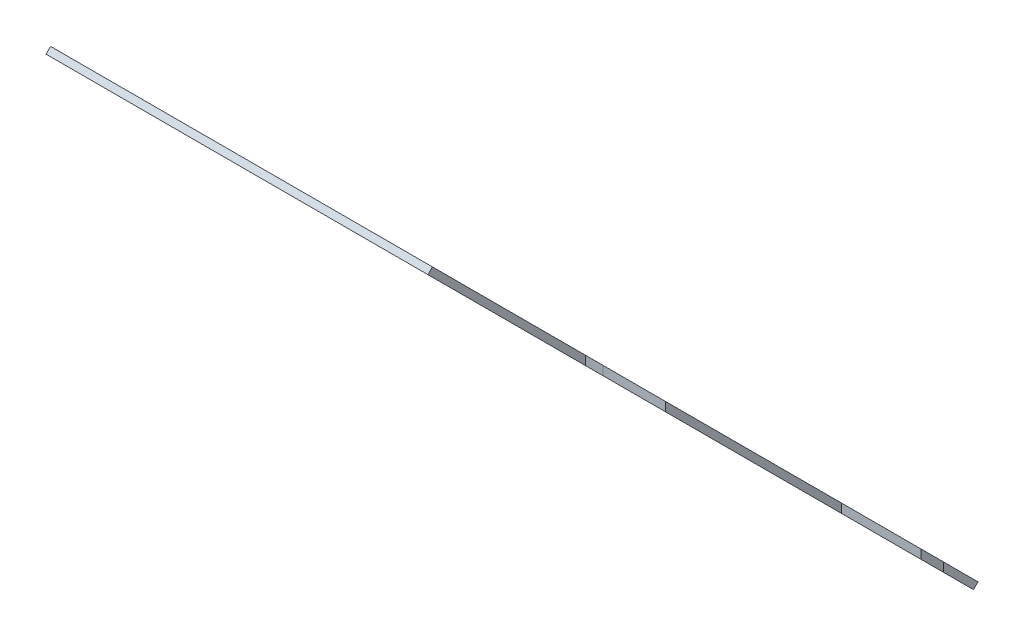
ISO-10303-21;
HEADER;
FILE_DESCRIPTION(('STEP AP214'),'2;1');
FILE_NAME('part.step','',(''),(''),'','','');
FILE_SCHEMA(('AUTOMOTIVE_DESIGN { 1 0 10303 214 1 1 1 1 }'));
ENDSEC;
DATA;
#1=APPLICATION_CONTEXT('core data for automotive mechanical design processes');
#2=APPLICATION_PROTOCOL_DEFINITION('international standard','automotive_design',2000,#1);
#3=PRODUCT_CONTEXT('',#1,'mechanical');
#4=PRODUCT('Part','Part','',(#3));
#5=PRODUCT_RELATED_PRODUCT_CATEGORY('part','',(#4));
#6=PRODUCT_DEFINITION_FORMATION('','',#4);
#7=PRODUCT_DEFINITION_CONTEXT('part definition',#1,'design');
#8=PRODUCT_DEFINITION('design','',#6,#7);
#9=PRODUCT_DEFINITION_SHAPE('','',#8);
#10=(LENGTH_UNIT() NAMED_UNIT(*) SI_UNIT(.MILLI.,.METRE.));
#11=(NAMED_UNIT(*) PLANE_ANGLE_UNIT() SI_UNIT($,.RADIAN.));
#12=(NAMED_UNIT(*) SI_UNIT($,.STERADIAN.) SOLID_ANGLE_UNIT());
#13=UNCERTAINTY_MEASURE_WITH_UNIT(LENGTH_MEASURE(1.E-05),#10,'distance_accuracy_value','');
#14=(GEOMETRIC_REPRESENTATION_CONTEXT(3) GLOBAL_UNCERTAINTY_ASSIGNED_CONTEXT((#13)) GLOBAL_UNIT_ASSIGNED_CONTEXT((#10,
#11,#12)) REPRESENTATION_CONTEXT('',''));
#15=CARTESIAN_POINT('',(0.,0.,0.));
#16=DIRECTION('',(0.,0.,1.));
#17=DIRECTION('',(1.,0.,0.));
#18=AXIS2_PLACEMENT_3D('',#15,#16,#17);
#19=CARTESIAN_POINT('',(-23399.5611417281,4644.14890589794,40199.9001950679));
#20=DIRECTION('',(0.,0.,-1.));
#21=DIRECTION('',(-1.,0.,0.));
#22=AXIS2_PLACEMENT_3D('',#19,#20,#21);
#23=PLANE('',#22);
#24=DIRECTION('',(1.,0.,0.));
#25=VECTOR('',#24,1.);
#26=CARTESIAN_POINT('',(-23399.5611417281,2810.99010375557,40199.9001950679));
#27=LINE('',#26,#25);
#28=CARTESIAN_POINT('',(-22901.5611417281,2810.99010375557,40199.9001950679));
#29=VERTEX_POINT('',#28);
#30=CARTESIAN_POINT('',(-22799.5611417281,2810.99010375557,40199.9001950679));
#31=VERTEX_POINT('',#30);
#32=EDGE_CURVE('E549',#29,#31,#27,.T.);
#33=ORIENTED_EDGE('',*,*,#32,.F.);
#34=DIRECTION('',(0.,1.,0.));
#35=VECTOR('',#34,1.);
#36=CARTESIAN_POINT('',(-22901.5611417281,0.,40199.9001950679));
#37=LINE('',#36,#35);
#38=CARTESIAN_POINT('',(-22901.5611417281,2825.1322393793,40199.9001950679));
#39=VERTEX_POINT('',#38);
#40=EDGE_CURVE('E491',#29,#39,#37,.T.);
#41=ORIENTED_EDGE('',*,*,#40,.T.);
#42=DIRECTION('',(1.,0.,0.));
#43=VECTOR('',#42,1.);
#44=CARTESIAN_POINT('',(-23399.5611417281,2825.1322393793,40199.9001950679));
#45=LINE('',#44,#43);
#46=CARTESIAN_POINT('',(-22799.5611417281,2825.1322393793,40199.9001950679));
#47=VERTEX_POINT('',#46);
#48=EDGE_CURVE('E570',#39,#47,#45,.T.);
#49=ORIENTED_EDGE('',*,*,#48,.T.);
#50=DIRECTION('',(0.,1.,0.));
#51=VECTOR('',#50,1.);
#52=CARTESIAN_POINT('',(-22799.5611417281,4644.14890589794,40199.9001950679));
#53=LINE('',#52,#51);
#54=EDGE_CURVE('E553',#31,#47,#53,.T.);
#55=ORIENTED_EDGE('',*,*,#54,.F.);
#56=EDGE_LOOP('',(#33,#41,#49,#55));
#57=FACE_BOUND('',#56,.T.);
#58=ADVANCED_FACE('F134',(#57),#23,.T.);
#59=CARTESIAN_POINT('',(-22799.5611417283,0.,1.12500434359537E-10));
#60=DIRECTION('',(-1.,0.,0.));
#61=DIRECTION('',(0.,0.,1.));
#62=AXIS2_PLACEMENT_3D('',#59,#60,#61);
#63=PLANE('',#62);
#64=DIRECTION('',(0.,-0.707106781186551,-0.707106781186544));
#65=VECTOR('',#64,1.);
#66=CARTESIAN_POINT('',(-22799.5611417281,3727.56950482676,41116.4795961391));
#67=LINE('',#66,#65);
#68=CARTESIAN_POINT('',(-22799.5611417281,3247.90013102599,40636.8102223383));
#69=VERTEX_POINT('',#68);
#70=CARTESIAN_POINT('',(-22799.5611417374,2971.2637149673,40360.1738062797));
#71=VERTEX_POINT('',#70);
#72=EDGE_CURVE('E554',#69,#71,#67,.T.);
#73=ORIENTED_EDGE('',*,*,#72,.T.);
#74=DIRECTION('',(0.,1.,0.));
#75=VECTOR('',#74,1.);
#76=CARTESIAN_POINT('',(-22799.5611417281,0.,40360.1738062797));
#77=LINE('',#76,#75);
#78=CARTESIAN_POINT('',(-22799.5611417374,2985.40585059103,40360.1738062797));
#79=VERTEX_POINT('',#78);
#80=EDGE_CURVE('E581',#71,#79,#77,.T.);
#81=ORIENTED_EDGE('',*,*,#80,.T.);
#82=DIRECTION('',(0.,0.70710678118655,0.707106781186545));
#83=VECTOR('',#82,1.);
#84=CARTESIAN_POINT('',(-22799.5611417281,3734.64057263863,41109.4085283273));
#85=LINE('',#84,#83);
#86=CARTESIAN_POINT('',(-22799.5611417281,3262.04226664972,40636.8102223383));
#87=VERTEX_POINT('',#86);
#88=EDGE_CURVE('E561',#79,#87,#85,.T.);
#89=ORIENTED_EDGE('',*,*,#88,.T.);
#90=DIRECTION('',(0.,-1.,0.));
#91=VECTOR('',#90,1.);
#92=CARTESIAN_POINT('',(-22799.5611417281,0.,40636.8102223383));
#93=LINE('',#92,#91);
#94=EDGE_CURVE('E566',#87,#69,#93,.T.);
#95=ORIENTED_EDGE('',*,*,#94,.T.);
#96=EDGE_LOOP('',(#73,#81,#89,#95));
#97=FACE_BOUND('',#96,.T.);
#98=ADVANCED_FACE('F602',(#97),#63,.F.);
#99=CARTESIAN_POINT('',(-22799.5611417281,3620.81394438943,41009.7240357018));
#100=VERTEX_POINT('',#99);
#101=CARTESIAN_POINT('',(-22799.5611417281,3373.04732691161,40761.957418224));
#102=VERTEX_POINT('',#101);
#103=EDGE_CURVE('E550',#100,#102,#67,.T.);
#104=ORIENTED_EDGE('',*,*,#103,.T.);
#105=DIRECTION('',(0.,1.,0.));
#106=VECTOR('',#105,1.);
#107=CARTESIAN_POINT('',(-22799.5611417281,0.,40761.957418224));
#108=LINE('',#107,#106);
#109=CARTESIAN_POINT('',(-22799.5611417281,3387.18946253534,40761.957418224));
#110=VERTEX_POINT('',#109);
#111=EDGE_CURVE('E575',#102,#110,#108,.T.);
#112=ORIENTED_EDGE('',*,*,#111,.T.);
#113=CARTESIAN_POINT('',(-22799.5611417281,3627.8850122013,41002.6529678899));
#114=VERTEX_POINT('',#113);
#115=EDGE_CURVE('E557',#110,#114,#85,.T.);
#116=ORIENTED_EDGE('',*,*,#115,.T.);
#117=DIRECTION('',(0.,-0.707106781186659,0.707106781186437));
#118=VECTOR('',#117,1.);
#119=CARTESIAN_POINT('',(-22799.5611417281,4537.39334546078,40093.1446346307));
#120=LINE('',#119,#118);
#121=EDGE_CURVE('E543',#114,#100,#120,.T.);
#122=ORIENTED_EDGE('',*,*,#121,.T.);
#123=EDGE_LOOP('',(#104,#112,#116,#122));
#124=FACE_BOUND('',#123,.T.);
#125=ADVANCED_FACE('F643',(#124),#63,.F.);
#126=CARTESIAN_POINT('',(-23399.5611417281,3727.56950482676,41116.4795961391));
#127=DIRECTION('',(0.,-0.707106781186544,0.707106781186551));
#128=DIRECTION('',(0.,-0.707106781186551,-0.707106781186544));
#129=AXIS2_PLACEMENT_3D('',#126,#127,#128);
#130=PLANE('',#129);
#131=CARTESIAN_POINT('',(-23359.5611417281,2813.47366232214,40202.3837536345));
#132=DIRECTION('',(0.,-0.707106781186544,0.707106781186551));
#133=DIRECTION('',(0.,-0.707106781186551,-0.707106781186544));
#134=AXIS2_PLACEMENT_3D('',#131,#132,#133);
#135=CIRCLE('',#134,10.0000000000016);
#136=CARTESIAN_POINT('',(-23369.5611417281,2813.47366232214,40202.3837536345));
#137=VERTEX_POINT('',#136);
#138=CARTESIAN_POINT('',(-23359.5611417281,2806.40259451028,40195.3126858226));
#139=VERTEX_POINT('',#138);
#140=EDGE_CURVE('E460',#137,#139,#135,.T.);
#141=ORIENTED_EDGE('',*,*,#140,.F.);
#142=DIRECTION('',(0.,-0.707106781186551,-0.707106781186544));
#143=VECTOR('',#142,1.);
#144=CARTESIAN_POINT('',(-23369.5611417281,3727.56950482676,41116.4795961391));
#145=LINE('',#144,#143);
#146=CARTESIAN_POINT('',(-23369.5611417281,3339.56110752494,40728.4711988373));
#147=VERTEX_POINT('',#146);
#148=EDGE_CURVE('E450',#147,#137,#145,.T.);
#149=ORIENTED_EDGE('',*,*,#148,.F.);
#150=CARTESIAN_POINT('',(-23359.5611417281,3339.56110752494,40728.4711988373));
#151=DIRECTION('',(0.,-0.707106781186544,0.707106781186551));
#152=DIRECTION('',(0.,-0.707106781186551,-0.707106781186544));
#153=AXIS2_PLACEMENT_3D('',#150,#151,#152);
#154=CIRCLE('',#153,9.99999999999973);
#155=CARTESIAN_POINT('',(-23359.5611417281,3346.6321753368,40735.5422666492));
#156=VERTEX_POINT('',#155);
#157=EDGE_CURVE('E485',#156,#147,#154,.T.);
#158=ORIENTED_EDGE('',*,*,#157,.F.);
#159=DIRECTION('',(-1.,0.,0.));
#160=VECTOR('',#159,1.);
#161=CARTESIAN_POINT('',(-23399.5611417281,3346.6321753368,40735.5422666492));
#162=LINE('',#161,#160);
#163=CARTESIAN_POINT('',(-23039.5611417281,3346.6321753368,40735.5422666492));
#164=VERTEX_POINT('',#163);
#165=EDGE_CURVE('E479',#164,#156,#162,.T.);
#166=ORIENTED_EDGE('',*,*,#165,.F.);
#167=CARTESIAN_POINT('',(-23039.5611417281,3339.56110752494,40728.4711988373));
#168=DIRECTION('',(0.,-0.707106781186544,0.707106781186551));
#169=DIRECTION('',(0.,-0.707106781186551,-0.707106781186544));
#170=AXIS2_PLACEMENT_3D('',#167,#168,#169);
#171=CIRCLE('',#170,10.0000000000048);
#172=CARTESIAN_POINT('',(-23039.5611417281,3332.49003971306,40721.4001310254));
#173=VERTEX_POINT('',#172);
#174=EDGE_CURVE('E350',#173,#164,#171,.T.);
#175=ORIENTED_EDGE('',*,*,#174,.F.);
#176=DIRECTION('',(-1.,0.,0.));
#177=VECTOR('',#176,1.);
#178=CARTESIAN_POINT('',(-23399.5611417281,3332.49003971307,40721.4001310254));
#179=LINE('',#178,#177);
#180=CARTESIAN_POINT('',(-23349.5611417281,3332.49003971307,40721.4001310254));
#181=VERTEX_POINT('',#180);
#182=EDGE_CURVE('E482',#173,#181,#179,.T.);
#183=ORIENTED_EDGE('',*,*,#182,.T.);
#184=DIRECTION('',(0.,-0.707106781186551,-0.707106781186544));
#185=VECTOR('',#184,1.);
#186=CARTESIAN_POINT('',(-23349.5611417281,3727.56950482676,41116.4795961391));
#187=LINE('',#186,#185);
#188=CARTESIAN_POINT('',(-23349.5611417281,3219.35295472323,40608.2630460356));
#189=VERTEX_POINT('',#188);
#190=EDGE_CURVE('E380',#181,#189,#187,.T.);
#191=ORIENTED_EDGE('',*,*,#190,.T.);
#192=DIRECTION('',(-1.,0.,0.));
#193=VECTOR('',#192,1.);
#194=CARTESIAN_POINT('',(-23399.5611417281,3219.35295472322,40608.2630460356));
#195=LINE('',#194,#193);
#196=CARTESIAN_POINT('',(-23039.5611417281,3219.35295472323,40608.2630460356));
#197=VERTEX_POINT('',#196);
#198=EDGE_CURVE('E448',#197,#189,#195,.T.);
#199=ORIENTED_EDGE('',*,*,#198,.F.);
#200=CARTESIAN_POINT('',(-23039.5611417281,3212.28188691136,40601.1919782237));
#201=DIRECTION('',(0.,-0.707106781186544,0.707106781186551));
#202=DIRECTION('',(0.,-0.707106781186551,-0.707106781186544));
#203=AXIS2_PLACEMENT_3D('',#200,#201,#202);
#204=CIRCLE('',#203,10.0000000000073);
#205=CARTESIAN_POINT('',(-23039.5611417281,3205.21081909949,40594.1209104118));
#206=VERTEX_POINT('',#205);
#207=EDGE_CURVE('E452',#206,#197,#204,.T.);
#208=ORIENTED_EDGE('',*,*,#207,.F.);
#209=DIRECTION('',(-1.,0.,0.));
#210=VECTOR('',#209,1.);
#211=CARTESIAN_POINT('',(-23399.5611417281,3205.21081909949,40594.1209104118));
#212=LINE('',#211,#210);
#213=CARTESIAN_POINT('',(-23349.5611417281,3205.21081909949,40594.1209104118));
#214=VERTEX_POINT('',#213);
#215=EDGE_CURVE('E454',#206,#214,#212,.T.);
#216=ORIENTED_EDGE('',*,*,#215,.T.);
#217=DIRECTION('',(0.,-0.707106781186551,-0.707106781186544));
#218=VECTOR('',#217,1.);
#219=CARTESIAN_POINT('',(-23349.5611417281,3727.56950482676,41116.4795961391));
#220=LINE('',#219,#218);
#221=CARTESIAN_POINT('',(-23349.5611417281,2947.82395074758,40336.7340420599));
#222=VERTEX_POINT('',#221);
#223=EDGE_CURVE('E457',#214,#222,#220,.T.);
#224=ORIENTED_EDGE('',*,*,#223,.T.);
#225=DIRECTION('',(1.,0.,0.));
#226=VECTOR('',#225,1.);
#227=CARTESIAN_POINT('',(-23399.561141728,2947.82395074758,40336.7340420599));
#228=LINE('',#227,#226);
#229=CARTESIAN_POINT('',(-23164.5611417281,2947.82395074759,40336.7340420599));
#230=VERTEX_POINT('',#229);
#231=EDGE_CURVE('E462',#222,#230,#228,.T.);
#232=ORIENTED_EDGE('',*,*,#231,.T.);
#233=CARTESIAN_POINT('',(-23164.5611417281,2940.75288293572,40329.6629742481));
#234=DIRECTION('',(0.,-0.707106781186544,0.707106781186551));
#235=DIRECTION('',(0.,-0.707106781186551,-0.707106781186544));
#236=AXIS2_PLACEMENT_3D('',#233,#234,#235);
#237=CIRCLE('',#236,10.0000000000035);
#238=CARTESIAN_POINT('',(-23164.5611417281,2933.68181512385,40322.5919064362));
#239=VERTEX_POINT('',#238);
#240=EDGE_CURVE('E470',#239,#230,#237,.T.);
#241=ORIENTED_EDGE('',*,*,#240,.F.);
#242=DIRECTION('',(1.,0.,0.));
#243=VECTOR('',#242,1.);
#244=CARTESIAN_POINT('',(-23399.5611417281,2933.68181512386,40322.5919064362));
#245=LINE('',#244,#243);
#246=CARTESIAN_POINT('',(-23349.5611417281,2933.68181512386,40322.5919064362));
#247=VERTEX_POINT('',#246);
#248=EDGE_CURVE('E472',#247,#239,#245,.T.);
#249=ORIENTED_EDGE('',*,*,#248,.F.);
#250=DIRECTION('',(0.,-0.707106781186551,-0.707106781186544));
#251=VECTOR('',#250,1.);
#252=CARTESIAN_POINT('',(-23349.5611417281,3727.56950482676,41116.4795961391));
#253=LINE('',#252,#251);
#254=CARTESIAN_POINT('',(-23349.5611417281,2820.54473013401,40209.4548214464));
#255=VERTEX_POINT('',#254);
#256=EDGE_CURVE('E465',#247,#255,#253,.T.);
#257=ORIENTED_EDGE('',*,*,#256,.T.);
#258=DIRECTION('',(1.,0.,0.));
#259=VECTOR('',#258,1.);
#260=CARTESIAN_POINT('',(-23399.5611417281,2820.54473013401,40209.4548214464));
#261=LINE('',#260,#259);
#262=CARTESIAN_POINT('',(-23164.5611417281,2820.54473013401,40209.4548214464));
#263=VERTEX_POINT('',#262);
#264=EDGE_CURVE('E474',#255,#263,#261,.T.);
#265=ORIENTED_EDGE('',*,*,#264,.T.);
#266=CARTESIAN_POINT('',(-23164.5611417281,2813.47366232214,40202.3837536345));
#267=DIRECTION('',(0.,-0.707106781186544,0.707106781186551));
#268=DIRECTION('',(0.,-0.707106781186551,-0.707106781186544));
#269=AXIS2_PLACEMENT_3D('',#266,#267,#268);
#270=CIRCLE('',#269,9.99999999999973);
#271=CARTESIAN_POINT('',(-23164.5611417281,2806.40259451028,40195.3126858226));
#272=VERTEX_POINT('',#271);
#273=EDGE_CURVE('E477',#272,#263,#270,.T.);
#274=ORIENTED_EDGE('',*,*,#273,.F.);
#275=DIRECTION('',(1.,0.,0.));
#276=VECTOR('',#275,1.);
#277=CARTESIAN_POINT('',(-23399.5611417281,2806.40259451027,40195.3126858226));
#278=LINE('',#277,#276);
#279=EDGE_CURVE('E468',#139,#272,#278,.T.);
#280=ORIENTED_EDGE('',*,*,#279,.F.);
#281=EDGE_LOOP('',(#141,#149,#158,#166,#175,#183,#191,#199,#208,#216,#224,#232,#241,#249,#257,
#265,#274,#280));
#282=FACE_BOUND('',#281,.T.);
#283=DIRECTION('',(-1.,0.,0.));
#284=VECTOR('',#283,1.);
#285=CARTESIAN_POINT('',(-23399.5611417281,2971.2637149673,40360.1738062797));
#286=LINE('',#285,#284);
#287=CARTESIAN_POINT('',(-23030.5480978763,2971.2637149673,40360.1738062797));
#288=VERTEX_POINT('',#287);
#289=EDGE_CURVE('E533',#71,#288,#286,.T.);
#290=ORIENTED_EDGE('',*,*,#289,.F.);
#291=ORIENTED_EDGE('',*,*,#72,.F.);
#292=DIRECTION('',(1.,0.,0.));
#293=VECTOR('',#292,1.);
#294=CARTESIAN_POINT('',(-23399.5611417281,3247.90013102604,40636.8102223384));
#295=LINE('',#294,#293);
#296=CARTESIAN_POINT('',(-22897.4106010305,3247.900131026,40636.8102223383));
#297=VERTEX_POINT('',#296);
#298=EDGE_CURVE('E521',#297,#69,#295,.T.);
#299=ORIENTED_EDGE('',*,*,#298,.F.);
#300=CARTESIAN_POINT('',(-22897.4106010305,3310.4737289688,40699.3838202812));
#301=DIRECTION('',(0.,-0.707106781186544,0.707106781186551));
#302=DIRECTION('',(0.,0.707106781186551,0.707106781186544));
#303=AXIS2_PLACEMENT_3D('',#300,#301,#302);
#304=ELLIPSE('',#303,88.4924308572015,62.5735979428086);
#305=CARTESIAN_POINT('',(-22897.4106010305,3373.04732691162,40761.957418224));
#306=VERTEX_POINT('',#305);
#307=EDGE_CURVE('E535',#306,#297,#304,.T.);
#308=ORIENTED_EDGE('',*,*,#307,.F.);
#309=DIRECTION('',(-1.,0.,0.));
#310=VECTOR('',#309,1.);
#311=CARTESIAN_POINT('',(-23399.5611417281,3373.04732691165,40761.957418224));
#312=LINE('',#311,#310);
#313=EDGE_CURVE('E525',#102,#306,#312,.T.);
#314=ORIENTED_EDGE('',*,*,#313,.F.);
#315=ORIENTED_EDGE('',*,*,#103,.F.);
#316=DIRECTION('',(1.,0.,0.));
#317=VECTOR('',#316,1.);
#318=CARTESIAN_POINT('',(-23399.5611417281,3620.81394438943,41009.7240357018));
#319=LINE('',#318,#317);
#320=CARTESIAN_POINT('',(-23399.5611417281,3620.81394438943,41009.7240357018));
#321=VERTEX_POINT('',#320);
#322=EDGE_CURVE('E564',#321,#100,#319,.T.);
#323=ORIENTED_EDGE('',*,*,#322,.F.);
#324=DIRECTION('',(0.,-0.707106781186551,-0.707106781186544));
#325=VECTOR('',#324,1.);
#326=CARTESIAN_POINT('',(-23399.5611417281,3727.56950482676,41116.4795961391));
#327=LINE('',#326,#325);
#328=CARTESIAN_POINT('',(-23399.5611417281,2661.79925775763,40050.70934907));
#329=VERTEX_POINT('',#328);
#330=EDGE_CURVE('E540',#321,#329,#327,.T.);
#331=ORIENTED_EDGE('',*,*,#330,.T.);
#332=DIRECTION('',(-1.,0.,0.));
#333=VECTOR('',#332,1.);
#334=CARTESIAN_POINT('',(-22675.5181179628,2661.79925775763,40050.70934907));
#335=LINE('',#334,#333);
#336=CARTESIAN_POINT('',(-22901.5611417281,2661.79925775763,40050.70934907));
#337=VERTEX_POINT('',#336);
#338=EDGE_CURVE('E492',#337,#329,#335,.T.);
#339=ORIENTED_EDGE('',*,*,#338,.F.);
#340=DIRECTION('',(0.,0.707106781186548,0.707106781186548));
#341=VECTOR('',#340,1.);
#342=CARTESIAN_POINT('',(-22901.5611417281,-18694.4550456561,18694.4550456562));
#343=LINE('',#342,#341);
#344=EDGE_CURVE('E488',#337,#29,#343,.T.);
#345=ORIENTED_EDGE('',*,*,#344,.T.);
#346=ORIENTED_EDGE('',*,*,#32,.T.);
#347=CARTESIAN_POINT('',(-22799.5611417281,2846.11651908168,40235.026610394));
#348=VERTEX_POINT('',#347);
#349=EDGE_CURVE('E539',#348,#31,#67,.T.);
#350=ORIENTED_EDGE('',*,*,#349,.F.);
#351=DIRECTION('',(1.,0.,0.));
#352=VECTOR('',#351,1.);
#353=CARTESIAN_POINT('',(-23399.5611417281,2846.11651908168,40235.026610394));
#354=LINE('',#353,#352);
#355=CARTESIAN_POINT('',(-23030.5480978763,2846.11651908168,40235.026610394));
#356=VERTEX_POINT('',#355);
#357=EDGE_CURVE('E529',#356,#348,#354,.T.);
#358=ORIENTED_EDGE('',*,*,#357,.F.);
#359=CARTESIAN_POINT('',(-23030.5480978763,2908.69011702449,40297.6002083369));
#360=DIRECTION('',(0.,-0.707106781186544,0.707106781186551));
#361=DIRECTION('',(0.,0.707106781186551,0.707106781186544));
#362=AXIS2_PLACEMENT_3D('',#359,#360,#361);
#363=ELLIPSE('',#362,88.4924308572015,62.5735979428086);
#364=EDGE_CURVE('E537',#288,#356,#363,.T.);
#365=ORIENTED_EDGE('',*,*,#364,.F.);
#366=EDGE_LOOP('',(#290,#291,#299,#308,#314,#315,#323,#331,#339,#345,#346,#350,#358,#365));
#367=FACE_BOUND('',#366,.T.);
#368=ADVANCED_FACE('F136',(#282,#367),#130,.T.);
#369=CARTESIAN_POINT('',(-23399.5611417281,4537.39334546078,40093.1446346307));
#370=DIRECTION('',(0.,0.707106781186436,0.707106781186658));
#371=DIRECTION('',(0.,-0.707106781186659,0.707106781186437));
#372=AXIS2_PLACEMENT_3D('',#369,#370,#371);
#373=PLANE('',#372);
#374=ORIENTED_EDGE('',*,*,#121,.F.);
#375=DIRECTION('',(1.,0.,0.));
#376=VECTOR('',#375,1.);
#377=CARTESIAN_POINT('',(-23399.5611417281,3627.8850122013,41002.6529678899));
#378=LINE('',#377,#376);
#379=CARTESIAN_POINT('',(-23399.5611417281,3627.8850122013,41002.6529678899));
#380=VERTEX_POINT('',#379);
#381=EDGE_CURVE('E567',#380,#114,#378,.T.);
#382=ORIENTED_EDGE('',*,*,#381,.F.);
#383=DIRECTION('',(0.,-0.707106781186659,0.707106781186437));
#384=VECTOR('',#383,1.);
#385=CARTESIAN_POINT('',(-23399.5611417281,4537.39334546078,40093.1446346307));
#386=LINE('',#385,#384);
#387=EDGE_CURVE('E546',#380,#321,#386,.T.);
#388=ORIENTED_EDGE('',*,*,#387,.T.);
#389=ORIENTED_EDGE('',*,*,#322,.T.);
#390=EDGE_LOOP('',(#374,#382,#388,#389));
#391=FACE_BOUND('',#390,.T.);
#392=ADVANCED_FACE('F649',(#391),#373,.T.);
#393=CARTESIAN_POINT('',(-23399.5611417281,3734.64057263863,41109.4085283273));
#394=DIRECTION('',(0.,0.707106781186545,-0.70710678118655));
#395=DIRECTION('',(0.,0.70710678118655,0.707106781186545));
#396=AXIS2_PLACEMENT_3D('',#393,#394,#395);
#397=PLANE('',#396);
#398=CARTESIAN_POINT('',(-23359.5611417281,2820.54473013403,40195.3126858226));
#399=DIRECTION('',(0.,0.707106781186544,-0.707106781186551));
#400=DIRECTION('',(0.,0.707106781186551,0.707106781186544));
#401=AXIS2_PLACEMENT_3D('',#398,#399,#400);
#402=CIRCLE('',#401,10.0000000000016);
#403=CARTESIAN_POINT('',(-23359.5611417281,2813.47366232216,40188.2416180107));
#404=VERTEX_POINT('',#403);
#405=CARTESIAN_POINT('',(-23369.5611417281,2820.54473013403,40195.3126858226));
#406=VERTEX_POINT('',#405);
#407=EDGE_CURVE('E381',#404,#406,#402,.T.);
#408=ORIENTED_EDGE('',*,*,#407,.F.);
#409=DIRECTION('',(-1.,0.,0.));
#410=VECTOR('',#409,1.);
#411=CARTESIAN_POINT('',(-23164.5611417281,2813.47366232216,40188.2416180107));
#412=LINE('',#411,#410);
#413=CARTESIAN_POINT('',(-23164.5611417281,2813.47366232216,40188.2416180107));
#414=VERTEX_POINT('',#413);
#415=EDGE_CURVE('E426',#414,#404,#412,.T.);
#416=ORIENTED_EDGE('',*,*,#415,.F.);
#417=CARTESIAN_POINT('',(-23164.5611417281,2820.54473013403,40195.3126858226));
#418=DIRECTION('',(0.,0.707106781186544,-0.707106781186551));
#419=DIRECTION('',(0.,0.707106781186551,0.707106781186544));
#420=AXIS2_PLACEMENT_3D('',#417,#418,#419);
#421=CIRCLE('',#420,9.99999999999973);
#422=CARTESIAN_POINT('',(-23164.5611417281,2827.6157979459,40202.3837536345));
#423=VERTEX_POINT('',#422);
#424=EDGE_CURVE('E423',#423,#414,#421,.T.);
#425=ORIENTED_EDGE('',*,*,#424,.F.);
#426=DIRECTION('',(-1.,0.,0.));
#427=VECTOR('',#426,1.);
#428=CARTESIAN_POINT('',(-23164.5611417281,2827.6157979459,40202.3837536345));
#429=LINE('',#428,#427);
#430=CARTESIAN_POINT('',(-23349.5611417281,2827.61579794589,40202.3837536345));
#431=VERTEX_POINT('',#430);
#432=EDGE_CURVE('E429',#423,#431,#429,.T.);
#433=ORIENTED_EDGE('',*,*,#432,.T.);
#434=DIRECTION('',(0.,0.70710678118655,0.707106781186545));
#435=VECTOR('',#434,1.);
#436=CARTESIAN_POINT('',(-23349.5611417281,2820.54473013403,40195.3126858226));
#437=LINE('',#436,#435);
#438=CARTESIAN_POINT('',(-23349.5611417281,2940.75288293574,40315.5208386243));
#439=VERTEX_POINT('',#438);
#440=EDGE_CURVE('E390',#431,#439,#437,.T.);
#441=ORIENTED_EDGE('',*,*,#440,.T.);
#442=DIRECTION('',(-1.,0.,0.));
#443=VECTOR('',#442,1.);
#444=CARTESIAN_POINT('',(-23164.5611417281,2940.75288293574,40315.5208386243));
#445=LINE('',#444,#443);
#446=CARTESIAN_POINT('',(-23164.5611417281,2940.75288293574,40315.5208386243));
#447=VERTEX_POINT('',#446);
#448=EDGE_CURVE('E413',#447,#439,#445,.T.);
#449=ORIENTED_EDGE('',*,*,#448,.F.);
#450=CARTESIAN_POINT('',(-23164.5611417281,2947.82395074761,40322.5919064362));
#451=DIRECTION('',(0.,0.707106781186544,-0.707106781186551));
#452=DIRECTION('',(0.,0.707106781186551,0.707106781186544));
#453=AXIS2_PLACEMENT_3D('',#450,#451,#452);
#454=CIRCLE('',#453,10.0000000000035);
#455=CARTESIAN_POINT('',(-23164.5611417281,2954.89501855948,40329.6629742481));
#456=VERTEX_POINT('',#455);
#457=EDGE_CURVE('E410',#456,#447,#454,.T.);
#458=ORIENTED_EDGE('',*,*,#457,.F.);
#459=DIRECTION('',(-1.,0.,0.));
#460=VECTOR('',#459,1.);
#461=CARTESIAN_POINT('',(-23164.5611417281,2954.89501855948,40329.6629742481));
#462=LINE('',#461,#460);
#463=CARTESIAN_POINT('',(-23349.5611417281,2954.89501855947,40329.6629742481));
#464=VERTEX_POINT('',#463);
#465=EDGE_CURVE('E417',#456,#464,#462,.T.);
#466=ORIENTED_EDGE('',*,*,#465,.T.);
#467=CARTESIAN_POINT('',(-23349.5611417281,3212.28188691137,40587.0498426));
#468=VERTEX_POINT('',#467);
#469=EDGE_CURVE('E389',#464,#468,#437,.T.);
#470=ORIENTED_EDGE('',*,*,#469,.T.);
#471=DIRECTION('',(1.,0.,0.));
#472=VECTOR('',#471,1.);
#473=CARTESIAN_POINT('',(-23359.5611417281,3212.28188691138,40587.0498426));
#474=LINE('',#473,#472);
#475=CARTESIAN_POINT('',(-23039.5611417281,3212.28188691137,40587.0498426));
#476=VERTEX_POINT('',#475);
#477=EDGE_CURVE('E404',#468,#476,#474,.T.);
#478=ORIENTED_EDGE('',*,*,#477,.T.);
#479=CARTESIAN_POINT('',(-23039.5611417281,3219.35295472324,40594.1209104118));
#480=DIRECTION('',(0.,0.707106781186544,-0.707106781186551));
#481=DIRECTION('',(0.,0.707106781186551,0.707106781186544));
#482=AXIS2_PLACEMENT_3D('',#479,#480,#481);
#483=CIRCLE('',#482,10.0000000000073);
#484=CARTESIAN_POINT('',(-23039.5611417281,3226.42402253511,40601.1919782237));
#485=VERTEX_POINT('',#484);
#486=EDGE_CURVE('E400',#485,#476,#483,.T.);
#487=ORIENTED_EDGE('',*,*,#486,.F.);
#488=DIRECTION('',(1.,0.,0.));
#489=VECTOR('',#488,1.);
#490=CARTESIAN_POINT('',(-23359.5611417281,3226.42402253511,40601.1919782237));
#491=LINE('',#490,#489);
#492=CARTESIAN_POINT('',(-23349.5611417281,3226.42402253511,40601.1919782237));
#493=VERTEX_POINT('',#492);
#494=EDGE_CURVE('E397',#493,#485,#491,.T.);
#495=ORIENTED_EDGE('',*,*,#494,.F.);
#496=CARTESIAN_POINT('',(-23349.5611417281,3339.56110752495,40714.3290632136));
#497=VERTEX_POINT('',#496);
#498=EDGE_CURVE('E387',#493,#497,#437,.T.);
#499=ORIENTED_EDGE('',*,*,#498,.T.);
#500=DIRECTION('',(1.,0.,0.));
#501=VECTOR('',#500,1.);
#502=CARTESIAN_POINT('',(7.37312262959926E-10,3339.56110752457,40714.3290632131));
#503=LINE('',#502,#501);
#504=CARTESIAN_POINT('',(-23039.5611417281,3339.56110752495,40714.3290632135));
#505=VERTEX_POINT('',#504);
#506=EDGE_CURVE('E157',#497,#505,#503,.T.);
#507=ORIENTED_EDGE('',*,*,#506,.T.);
#508=CARTESIAN_POINT('',(-23039.5611417281,3346.63217533682,40721.4001310254));
#509=DIRECTION('',(0.,0.707106781186544,-0.707106781186551));
#510=DIRECTION('',(0.,0.707106781186551,0.707106781186544));
#511=AXIS2_PLACEMENT_3D('',#508,#509,#510);
#512=CIRCLE('',#511,10.0000000000048);
#513=CARTESIAN_POINT('',(-23039.5611417281,3353.70324314869,40728.4711988373));
#514=VERTEX_POINT('',#513);
#515=EDGE_CURVE('E348',#514,#505,#512,.T.);
#516=ORIENTED_EDGE('',*,*,#515,.F.);
#517=DIRECTION('',(1.,0.,0.));
#518=VECTOR('',#517,1.);
#519=CARTESIAN_POINT('',(-2.41037610123161E-10,3353.70324314882,40728.4711988374));
#520=LINE('',#519,#518);
#521=CARTESIAN_POINT('',(-23359.5611417281,3353.70324314868,40728.4711988373));
#522=VERTEX_POINT('',#521);
#523=EDGE_CURVE('E357',#522,#514,#520,.T.);
#524=ORIENTED_EDGE('',*,*,#523,.F.);
#525=CARTESIAN_POINT('',(-23359.5611417281,3346.63217533682,40721.4001310254));
#526=DIRECTION('',(0.,0.707106781186544,-0.707106781186551));
#527=DIRECTION('',(0.,0.707106781186551,0.707106781186544));
#528=AXIS2_PLACEMENT_3D('',#525,#526,#527);
#529=CIRCLE('',#528,9.99999999999973);
#530=CARTESIAN_POINT('',(-23369.5611417281,3346.63217533682,40721.4001310254));
#531=VERTEX_POINT('',#530);
#532=EDGE_CURVE('E354',#531,#522,#529,.T.);
#533=ORIENTED_EDGE('',*,*,#532,.F.);
#534=DIRECTION('',(0.,0.70710678118655,0.707106781186545));
#535=VECTOR('',#534,1.);
#536=CARTESIAN_POINT('',(-23369.5611417281,2820.54473013403,40195.3126858226));
#537=LINE('',#536,#535);
#538=EDGE_CURVE('E384',#406,#531,#537,.T.);
#539=ORIENTED_EDGE('',*,*,#538,.F.);
#540=EDGE_LOOP('',(#408,#416,#425,#433,#441,#449,#458,#466,#470,#478,#487,#495,#499,#507,#516,
#524,#533,#539));
#541=FACE_BOUND('',#540,.T.);
#542=DIRECTION('',(1.,0.,0.));
#543=VECTOR('',#542,1.);
#544=CARTESIAN_POINT('',(-23399.5611417281,2985.40585059103,40360.1738062797));
#545=LINE('',#544,#543);
#546=CARTESIAN_POINT('',(-23030.5480978763,2985.40585059103,40360.1738062797));
#547=VERTEX_POINT('',#546);
#548=EDGE_CURVE('E531',#547,#79,#545,.T.);
#549=ORIENTED_EDGE('',*,*,#548,.F.);
#550=CARTESIAN_POINT('',(-23030.5480978763,2922.83225264822,40297.6002083369));
#551=DIRECTION('',(0.,0.707106781186545,-0.70710678118655));
#552=DIRECTION('',(0.,0.70710678118655,0.707106781186545));
#553=AXIS2_PLACEMENT_3D('',#550,#551,#552);
#554=ELLIPSE('',#553,88.4924308572014,62.5735979428086);
#555=CARTESIAN_POINT('',(-23030.5480978763,2860.25865470542,40235.026610394));
#556=VERTEX_POINT('',#555);
#557=EDGE_CURVE('E12',#556,#547,#554,.T.);
#558=ORIENTED_EDGE('',*,*,#557,.F.);
#559=DIRECTION('',(-1.,0.,0.));
#560=VECTOR('',#559,1.);
#561=CARTESIAN_POINT('',(-23399.5611417281,2860.25865470542,40235.026610394));
#562=LINE('',#561,#560);
#563=CARTESIAN_POINT('',(-22799.5611417374,2860.25865470542,40235.026610394));
#564=VERTEX_POINT('',#563);
#565=EDGE_CURVE('E527',#564,#556,#562,.T.);
#566=ORIENTED_EDGE('',*,*,#565,.F.);
#567=EDGE_CURVE('E558',#47,#564,#85,.T.);
#568=ORIENTED_EDGE('',*,*,#567,.F.);
#569=ORIENTED_EDGE('',*,*,#48,.F.);
#570=DIRECTION('',(0.,-0.707106781186551,-0.707106781186545));
#571=VECTOR('',#570,1.);
#572=CARTESIAN_POINT('',(-22901.5611417281,-18687.3839778443,18687.3839778445));
#573=LINE('',#572,#571);
#574=CARTESIAN_POINT('',(-22901.5611417281,2668.8703255695,40043.6382812581));
#575=VERTEX_POINT('',#574);
#576=EDGE_CURVE('E495',#39,#575,#573,.T.);
#577=ORIENTED_EDGE('',*,*,#576,.T.);
#578=DIRECTION('',(-1.,0.,0.));
#579=VECTOR('',#578,1.);
#580=CARTESIAN_POINT('',(-22675.5181179628,2668.8703255695,40043.6382812581));
#581=LINE('',#580,#579);
#582=CARTESIAN_POINT('',(-23399.5611417281,2668.8703255695,40043.6382812581));
#583=VERTEX_POINT('',#582);
#584=EDGE_CURVE('E501',#575,#583,#581,.T.);
#585=ORIENTED_EDGE('',*,*,#584,.T.);
#586=DIRECTION('',(0.,0.70710678118655,0.707106781186545));
#587=VECTOR('',#586,1.);
#588=CARTESIAN_POINT('',(-23399.5611417281,3734.64057263863,41109.4085283273));
#589=LINE('',#588,#587);
#590=EDGE_CURVE('E542',#583,#380,#589,.T.);
#591=ORIENTED_EDGE('',*,*,#590,.T.);
#592=ORIENTED_EDGE('',*,*,#381,.T.);
#593=ORIENTED_EDGE('',*,*,#115,.F.);
#594=DIRECTION('',(1.,0.,0.));
#595=VECTOR('',#594,1.);
#596=CARTESIAN_POINT('',(-23399.5611417281,3387.18946253538,40761.957418224));
#597=LINE('',#596,#595);
#598=CARTESIAN_POINT('',(-22897.4106010305,3387.18946253535,40761.957418224));
#599=VERTEX_POINT('',#598);
#600=EDGE_CURVE('E523',#599,#110,#597,.T.);
#601=ORIENTED_EDGE('',*,*,#600,.F.);
#602=CARTESIAN_POINT('',(-22897.4106010305,3324.61586459253,40699.3838202812));
#603=DIRECTION('',(0.,0.707106781186545,-0.70710678118655));
#604=DIRECTION('',(0.,0.70710678118655,0.707106781186545));
#605=AXIS2_PLACEMENT_3D('',#602,#603,#604);
#606=ELLIPSE('',#605,88.4924308572014,62.5735979428086);
#607=CARTESIAN_POINT('',(-22897.4106010305,3262.04226664973,40636.8102223383));
#608=VERTEX_POINT('',#607);
#609=EDGE_CURVE('E142',#608,#599,#606,.T.);
#610=ORIENTED_EDGE('',*,*,#609,.F.);
#611=DIRECTION('',(-1.,0.,0.));
#612=VECTOR('',#611,1.);
#613=CARTESIAN_POINT('',(-23399.5611417281,3262.04226664977,40636.8102223384));
#614=LINE('',#613,#612);
#615=EDGE_CURVE('E511',#87,#608,#614,.T.);
#616=ORIENTED_EDGE('',*,*,#615,.F.);
#617=ORIENTED_EDGE('',*,*,#88,.F.);
#618=EDGE_LOOP('',(#549,#558,#566,#568,#569,#577,#585,#591,#592,#593,#601,#610,#616,#617));
#619=FACE_BOUND('',#618,.T.);
#620=ADVANCED_FACE('F367',(#541,#619),#397,.T.);
#621=CARTESIAN_POINT('',(-23399.5611417283,0.,1.12500434359537E-10));
#622=DIRECTION('',(-1.,0.,0.));
#623=DIRECTION('',(0.,0.,1.));
#624=AXIS2_PLACEMENT_3D('',#621,#622,#623);
#625=PLANE('',#624);
#626=ORIENTED_EDGE('',*,*,#330,.F.);
#627=ORIENTED_EDGE('',*,*,#387,.F.);
#628=ORIENTED_EDGE('',*,*,#590,.F.);
#629=DIRECTION('',(0.,-0.70710678118657,0.707106781186525));
#630=VECTOR('',#629,1.);
#631=CARTESIAN_POINT('',(-23399.5611417281,21356.2543034137,21356.2543034151));
#632=LINE('',#631,#630);
#633=EDGE_CURVE('E487',#583,#329,#632,.T.);
#634=ORIENTED_EDGE('',*,*,#633,.T.);
#635=EDGE_LOOP('',(#626,#627,#628,#634));
#636=FACE_BOUND('',#635,.T.);
#637=ADVANCED_FACE('F648',(#636),#625,.T.);
#638=ORIENTED_EDGE('',*,*,#567,.T.);
#639=DIRECTION('',(0.,-1.,0.));
#640=VECTOR('',#639,1.);
#641=CARTESIAN_POINT('',(-22799.5611417281,0.,40235.026610394));
#642=LINE('',#641,#640);
#643=EDGE_CURVE('E578',#564,#348,#642,.T.);
#644=ORIENTED_EDGE('',*,*,#643,.T.);
#645=ORIENTED_EDGE('',*,*,#349,.T.);
#646=ORIENTED_EDGE('',*,*,#54,.T.);
#647=EDGE_LOOP('',(#638,#644,#645,#646));
#648=FACE_BOUND('',#647,.T.);
#649=ADVANCED_FACE('F615',(#648),#63,.F.);
#650=CARTESIAN_POINT('',(-22799.5611417281,2810.99010375557,40761.957418224));
#651=DIRECTION('',(0.,0.,1.));
#652=DIRECTION('',(1.,0.,0.));
#653=AXIS2_PLACEMENT_3D('',#650,#651,#652);
#654=PLANE('',#653);
#655=ORIENTED_EDGE('',*,*,#313,.T.);
#656=DIRECTION('',(0.,1.,0.));
#657=VECTOR('',#656,1.);
#658=CARTESIAN_POINT('',(-22897.4106010305,2810.99010375557,40761.957418224));
#659=LINE('',#658,#657);
#660=EDGE_CURVE('E507',#306,#599,#659,.T.);
#661=ORIENTED_EDGE('',*,*,#660,.T.);
#662=ORIENTED_EDGE('',*,*,#600,.T.);
#663=ORIENTED_EDGE('',*,*,#111,.F.);
#664=EDGE_LOOP('',(#655,#661,#662,#663));
#665=FACE_BOUND('',#664,.T.);
#666=ADVANCED_FACE('F592',(#665),#654,.F.);
#667=CARTESIAN_POINT('',(-22897.4106010305,2810.99010375557,40699.3838202812));
#668=DIRECTION('',(0.,1.,0.));
#669=DIRECTION('',(0.,0.,1.));
#670=AXIS2_PLACEMENT_3D('',#667,#668,#669);
#671=CYLINDRICAL_SURFACE('',#670,62.5735979428086);
#672=ORIENTED_EDGE('',*,*,#307,.T.);
#673=DIRECTION('',(0.,1.,0.));
#674=VECTOR('',#673,1.);
#675=CARTESIAN_POINT('',(-22897.4106010305,2810.99010375557,40636.8102223383));
#676=LINE('',#675,#674);
#677=EDGE_CURVE('E515',#297,#608,#676,.T.);
#678=ORIENTED_EDGE('',*,*,#677,.T.);
#679=ORIENTED_EDGE('',*,*,#609,.T.);
#680=ORIENTED_EDGE('',*,*,#660,.F.);
#681=EDGE_LOOP('',(#672,#678,#679,#680));
#682=FACE_BOUND('',#681,.T.);
#683=ADVANCED_FACE('F586',(#682),#671,.F.);
#684=CARTESIAN_POINT('',(-22799.5611417281,2810.99010375557,40636.8102223383));
#685=DIRECTION('',(0.,0.,-1.));
#686=DIRECTION('',(-1.,0.,0.));
#687=AXIS2_PLACEMENT_3D('',#684,#685,#686);
#688=PLANE('',#687);
#689=ORIENTED_EDGE('',*,*,#298,.T.);
#690=ORIENTED_EDGE('',*,*,#94,.F.);
#691=ORIENTED_EDGE('',*,*,#615,.T.);
#692=ORIENTED_EDGE('',*,*,#677,.F.);
#693=EDGE_LOOP('',(#689,#690,#691,#692));
#694=FACE_BOUND('',#693,.T.);
#695=ADVANCED_FACE('F606',(#694),#688,.F.);
#696=CARTESIAN_POINT('',(-22799.5611417374,2810.99010375557,40360.1738062797));
#697=DIRECTION('',(0.,0.,1.));
#698=DIRECTION('',(1.,0.,0.));
#699=AXIS2_PLACEMENT_3D('',#696,#697,#698);
#700=PLANE('',#699);
#701=ORIENTED_EDGE('',*,*,#289,.T.);
#702=DIRECTION('',(0.,1.,0.));
#703=VECTOR('',#702,1.);
#704=CARTESIAN_POINT('',(-23030.5480978763,2810.99010375557,40360.1738062797));
#705=LINE('',#704,#703);
#706=EDGE_CURVE('E508',#288,#547,#705,.T.);
#707=ORIENTED_EDGE('',*,*,#706,.T.);
#708=ORIENTED_EDGE('',*,*,#548,.T.);
#709=ORIENTED_EDGE('',*,*,#80,.F.);
#710=EDGE_LOOP('',(#701,#707,#708,#709));
#711=FACE_BOUND('',#710,.T.);
#712=ADVANCED_FACE('F629',(#711),#700,.F.);
#713=CARTESIAN_POINT('',(-23030.5480978763,2810.99010375557,40297.6002083369));
#714=DIRECTION('',(0.,1.,0.));
#715=DIRECTION('',(0.,0.,1.));
#716=AXIS2_PLACEMENT_3D('',#713,#714,#715);
#717=CYLINDRICAL_SURFACE('',#716,62.5735979428086);
#718=ORIENTED_EDGE('',*,*,#364,.T.);
#719=DIRECTION('',(0.,1.,0.));
#720=VECTOR('',#719,1.);
#721=CARTESIAN_POINT('',(-23030.5480978763,2810.99010375557,40235.026610394));
#722=LINE('',#721,#720);
#723=EDGE_CURVE('E512',#356,#556,#722,.T.);
#724=ORIENTED_EDGE('',*,*,#723,.T.);
#725=ORIENTED_EDGE('',*,*,#557,.T.);
#726=ORIENTED_EDGE('',*,*,#706,.F.);
#727=EDGE_LOOP('',(#718,#724,#725,#726));
#728=FACE_BOUND('',#727,.T.);
#729=ADVANCED_FACE('F626',(#728),#717,.F.);
#730=CARTESIAN_POINT('',(-22799.5611417374,2810.99010375557,40235.026610394));
#731=DIRECTION('',(0.,0.,-1.));
#732=DIRECTION('',(-1.,0.,0.));
#733=AXIS2_PLACEMENT_3D('',#730,#731,#732);
#734=PLANE('',#733);
#735=ORIENTED_EDGE('',*,*,#357,.T.);
#736=ORIENTED_EDGE('',*,*,#643,.F.);
#737=ORIENTED_EDGE('',*,*,#565,.T.);
#738=ORIENTED_EDGE('',*,*,#723,.F.);
#739=EDGE_LOOP('',(#735,#736,#737,#738));
#740=FACE_BOUND('',#739,.T.);
#741=ADVANCED_FACE('F624',(#740),#734,.F.);
#742=CARTESIAN_POINT('',(-22675.5181179629,21356.2543034137,21356.2543034151));
#743=DIRECTION('',(0.,-0.707106781186525,-0.70710678118657));
#744=DIRECTION('',(0.,0.70710678118657,-0.707106781186525));
#745=AXIS2_PLACEMENT_3D('',#742,#743,#744);
#746=PLANE('',#745);
#747=DIRECTION('',(0.,0.70710678118657,-0.707106781186525));
#748=VECTOR('',#747,1.);
#749=CARTESIAN_POINT('',(-22901.5611417281,21356.2543034137,21356.2543034151));
#750=LINE('',#749,#748);
#751=EDGE_CURVE('E498',#337,#575,#750,.T.);
#752=ORIENTED_EDGE('',*,*,#751,.F.);
#753=ORIENTED_EDGE('',*,*,#338,.T.);
#754=ORIENTED_EDGE('',*,*,#633,.F.);
#755=ORIENTED_EDGE('',*,*,#584,.F.);
#756=EDGE_LOOP('',(#752,#753,#754,#755));
#757=FACE_BOUND('',#756,.T.);
#758=ADVANCED_FACE('F662',(#757),#746,.T.);
#759=CARTESIAN_POINT('',(-22901.5611417281,4644.14890589794,40189.1001950679));
#760=DIRECTION('',(-1.,0.,0.));
#761=DIRECTION('',(0.,0.,1.));
#762=AXIS2_PLACEMENT_3D('',#759,#760,#761);
#763=PLANE('',#762);
#764=ORIENTED_EDGE('',*,*,#40,.F.);
#765=ORIENTED_EDGE('',*,*,#344,.F.);
#766=ORIENTED_EDGE('',*,*,#751,.T.);
#767=ORIENTED_EDGE('',*,*,#576,.F.);
#768=EDGE_LOOP('',(#764,#765,#766,#767));
#769=FACE_BOUND('',#768,.T.);
#770=ADVANCED_FACE('F666',(#769),#763,.F.);
#771=CARTESIAN_POINT('',(-23359.5611417281,2860.05376420904,41207.9785421532));
#772=DIRECTION('',(0.,0.707106781186544,-0.707106781186551));
#773=DIRECTION('',(0.,0.707106781186551,0.707106781186544));
#774=AXIS2_PLACEMENT_3D('',#771,#772,#773);
#775=CYLINDRICAL_SURFACE('',#774,9.99999999999973);
#776=ORIENTED_EDGE('',*,*,#157,.T.);
#777=DIRECTION('',(0.,0.707106781186544,-0.707106781186551));
#778=VECTOR('',#777,1.);
#779=CARTESIAN_POINT('',(-23369.5611417281,2860.05376420904,41207.9785421532));
#780=LINE('',#779,#778);
#781=EDGE_CURVE('E377',#531,#147,#780,.F.);
#782=ORIENTED_EDGE('',*,*,#781,.F.);
#783=ORIENTED_EDGE('',*,*,#532,.T.);
#784=DIRECTION('',(0.,0.707106781186544,-0.707106781186551));
#785=VECTOR('',#784,1.);
#786=CARTESIAN_POINT('',(-23359.5611417281,2867.1248320209,41215.0496099651));
#787=LINE('',#786,#785);
#788=EDGE_CURVE('E360',#156,#522,#787,.T.);
#789=ORIENTED_EDGE('',*,*,#788,.F.);
#790=EDGE_LOOP('',(#776,#782,#783,#789));
#791=FACE_BOUND('',#790,.T.);
#792=ADVANCED_FACE('F671',(#791),#775,.F.);
#793=CARTESIAN_POINT('',(7.37312262959926E-10,2852.98269639678,41200.9074743409));
#794=DIRECTION('',(0.,0.707106781186551,0.707106781186544));
#795=DIRECTION('',(0.,-0.707106781186544,0.707106781186551));
#796=AXIS2_PLACEMENT_3D('',#793,#794,#795);
#797=PLANE('',#796);
#798=DIRECTION('',(0.,0.707106781186544,-0.707106781186551));
#799=VECTOR('',#798,1.);
#800=CARTESIAN_POINT('',(-23039.5611417281,2852.98269639717,41200.9074743413));
#801=LINE('',#800,#799);
#802=EDGE_CURVE('E353',#173,#505,#801,.T.);
#803=ORIENTED_EDGE('',*,*,#802,.T.);
#804=ORIENTED_EDGE('',*,*,#506,.F.);
#805=DIRECTION('',(0.,-0.707106781186544,0.707106781186551));
#806=VECTOR('',#805,1.);
#807=CARTESIAN_POINT('',(-23349.5611417281,2852.98269639717,41200.9074743413));
#808=LINE('',#807,#806);
#809=EDGE_CURVE('E375',#497,#181,#808,.T.);
#810=ORIENTED_EDGE('',*,*,#809,.T.);
#811=ORIENTED_EDGE('',*,*,#182,.F.);
#812=EDGE_LOOP('',(#803,#804,#810,#811));
#813=FACE_BOUND('',#812,.T.);
#814=ADVANCED_FACE('F674',(#813),#797,.T.);
#815=CARTESIAN_POINT('',(-23039.5611417281,2860.05376420904,41207.9785421532));
#816=DIRECTION('',(0.,0.707106781186544,-0.707106781186551));
#817=DIRECTION('',(0.,0.707106781186551,0.707106781186544));
#818=AXIS2_PLACEMENT_3D('',#815,#816,#817);
#819=CYLINDRICAL_SURFACE('',#818,10.0000000000048);
#820=ORIENTED_EDGE('',*,*,#174,.T.);
#821=DIRECTION('',(0.,0.707106781186544,-0.707106781186551));
#822=VECTOR('',#821,1.);
#823=CARTESIAN_POINT('',(-23039.5611417281,2867.12483202091,41215.0496099651));
#824=LINE('',#823,#822);
#825=EDGE_CURVE('E343',#164,#514,#824,.T.);
#826=ORIENTED_EDGE('',*,*,#825,.T.);
#827=ORIENTED_EDGE('',*,*,#515,.T.);
#828=ORIENTED_EDGE('',*,*,#802,.F.);
#829=EDGE_LOOP('',(#820,#826,#827,#828));
#830=FACE_BOUND('',#829,.T.);
#831=ADVANCED_FACE('F345',(#830),#819,.F.);
#832=CARTESIAN_POINT('',(-2.41037610123161E-10,2867.12483202104,41215.0496099652));
#833=DIRECTION('',(0.,0.707106781186551,0.707106781186544));
#834=DIRECTION('',(0.,-0.707106781186544,0.707106781186551));
#835=AXIS2_PLACEMENT_3D('',#832,#833,#834);
#836=PLANE('',#835);
#837=ORIENTED_EDGE('',*,*,#165,.T.);
#838=ORIENTED_EDGE('',*,*,#788,.T.);
#839=ORIENTED_EDGE('',*,*,#523,.T.);
#840=ORIENTED_EDGE('',*,*,#825,.F.);
#841=EDGE_LOOP('',(#837,#838,#839,#840));
#842=FACE_BOUND('',#841,.T.);
#843=ADVANCED_FACE('F358',(#842),#836,.F.);
#844=CARTESIAN_POINT('',(-23164.5611417281,2333.96631900625,40681.8910969504));
#845=DIRECTION('',(0.,0.707106781186544,-0.707106781186551));
#846=DIRECTION('',(0.,0.707106781186551,0.707106781186544));
#847=AXIS2_PLACEMENT_3D('',#844,#845,#846);
#848=CYLINDRICAL_SURFACE('',#847,9.99999999999973);
#849=ORIENTED_EDGE('',*,*,#273,.T.);
#850=DIRECTION('',(0.,0.707106781186544,-0.707106781186551));
#851=VECTOR('',#850,1.);
#852=CARTESIAN_POINT('',(-23164.5611417281,2341.03738681811,40688.9621647623));
#853=LINE('',#852,#851);
#854=EDGE_CURVE('E414',#263,#423,#853,.T.);
#855=ORIENTED_EDGE('',*,*,#854,.T.);
#856=ORIENTED_EDGE('',*,*,#424,.T.);
#857=DIRECTION('',(0.,0.707106781186544,-0.707106781186551));
#858=VECTOR('',#857,1.);
#859=CARTESIAN_POINT('',(-23164.5611417281,2326.89525119438,40674.8200291385));
#860=LINE('',#859,#858);
#861=EDGE_CURVE('E432',#272,#414,#860,.T.);
#862=ORIENTED_EDGE('',*,*,#861,.F.);
#863=EDGE_LOOP('',(#849,#855,#856,#862));
#864=FACE_BOUND('',#863,.T.);
#865=ADVANCED_FACE('F677',(#864),#848,.F.);
#866=CARTESIAN_POINT('',(-23164.5611417281,2341.03738681811,40688.9621647623));
#867=DIRECTION('',(0.,-0.707106781186551,-0.707106781186544));
#868=DIRECTION('',(0.,0.707106781186544,-0.707106781186551));
#869=AXIS2_PLACEMENT_3D('',#866,#867,#868);
#870=PLANE('',#869);
#871=DIRECTION('',(0.,-0.707106781186544,0.707106781186551));
#872=VECTOR('',#871,1.);
#873=CARTESIAN_POINT('',(-23349.5611417281,2341.03738681811,40688.9621647623));
#874=LINE('',#873,#872);
#875=EDGE_CURVE('E393',#431,#255,#874,.T.);
#876=ORIENTED_EDGE('',*,*,#875,.F.);
#877=ORIENTED_EDGE('',*,*,#432,.F.);
#878=ORIENTED_EDGE('',*,*,#854,.F.);
#879=ORIENTED_EDGE('',*,*,#264,.F.);
#880=EDGE_LOOP('',(#876,#877,#878,#879));
#881=FACE_BOUND('',#880,.T.);
#882=ADVANCED_FACE('F680',(#881),#870,.T.);
#883=CARTESIAN_POINT('',(-23164.5611417281,2454.17447180796,40802.0992497521));
#884=DIRECTION('',(0.,-0.707106781186551,-0.707106781186544));
#885=DIRECTION('',(0.,0.707106781186544,-0.707106781186551));
#886=AXIS2_PLACEMENT_3D('',#883,#884,#885);
#887=PLANE('',#886);
#888=ORIENTED_EDGE('',*,*,#248,.T.);
#889=DIRECTION('',(0.,0.707106781186544,-0.707106781186551));
#890=VECTOR('',#889,1.);
#891=CARTESIAN_POINT('',(-23164.5611417281,2454.17447180796,40802.0992497521));
#892=LINE('',#891,#890);
#893=EDGE_CURVE('E420',#239,#447,#892,.T.);
#894=ORIENTED_EDGE('',*,*,#893,.T.);
#895=ORIENTED_EDGE('',*,*,#448,.T.);
#896=DIRECTION('',(0.,-0.707106781186544,0.707106781186551));
#897=VECTOR('',#896,1.);
#898=CARTESIAN_POINT('',(-23349.5611417281,2454.17447180796,40802.0992497521));
#899=LINE('',#898,#897);
#900=EDGE_CURVE('E437',#439,#247,#899,.T.);
#901=ORIENTED_EDGE('',*,*,#900,.T.);
#902=EDGE_LOOP('',(#888,#894,#895,#901));
#903=FACE_BOUND('',#902,.T.);
#904=ADVANCED_FACE('F690',(#903),#887,.F.);
#905=CARTESIAN_POINT('',(-23164.5611417281,2461.24553961983,40809.170317564));
#906=DIRECTION('',(0.,0.707106781186544,-0.707106781186551));
#907=DIRECTION('',(0.,0.707106781186551,0.707106781186544));
#908=AXIS2_PLACEMENT_3D('',#905,#906,#907);
#909=CYLINDRICAL_SURFACE('',#908,10.0000000000035);
#910=ORIENTED_EDGE('',*,*,#240,.T.);
#911=DIRECTION('',(0.,0.707106781186544,-0.707106781186551));
#912=VECTOR('',#911,1.);
#913=CARTESIAN_POINT('',(-23164.5611417281,2468.31660743169,40816.2413853758));
#914=LINE('',#913,#912);
#915=EDGE_CURVE('E401',#230,#456,#914,.T.);
#916=ORIENTED_EDGE('',*,*,#915,.T.);
#917=ORIENTED_EDGE('',*,*,#457,.T.);
#918=ORIENTED_EDGE('',*,*,#893,.F.);
#919=EDGE_LOOP('',(#910,#916,#917,#918));
#920=FACE_BOUND('',#919,.T.);
#921=ADVANCED_FACE('F686',(#920),#909,.F.);
#922=CARTESIAN_POINT('',(-23164.5611417281,2326.89525119438,40674.8200291385));
#923=DIRECTION('',(0.,-0.707106781186551,-0.707106781186544));
#924=DIRECTION('',(0.,0.707106781186544,-0.707106781186551));
#925=AXIS2_PLACEMENT_3D('',#922,#923,#924);
#926=PLANE('',#925);
#927=ORIENTED_EDGE('',*,*,#279,.T.);
#928=ORIENTED_EDGE('',*,*,#861,.T.);
#929=ORIENTED_EDGE('',*,*,#415,.T.);
#930=DIRECTION('',(0.,0.707106781186544,-0.707106781186551));
#931=VECTOR('',#930,1.);
#932=CARTESIAN_POINT('',(-23359.5611417281,2326.89525119438,40674.8200291385));
#933=LINE('',#932,#931);
#934=EDGE_CURVE('E364',#404,#139,#933,.F.);
#935=ORIENTED_EDGE('',*,*,#934,.T.);
#936=EDGE_LOOP('',(#927,#928,#929,#935));
#937=FACE_BOUND('',#936,.T.);
#938=ADVANCED_FACE('F682',(#937),#926,.F.);
#939=CARTESIAN_POINT('',(-23349.5611417281,2333.96631900625,40681.8910969504));
#940=DIRECTION('',(-1.,0.,0.));
#941=DIRECTION('',(0.,0.,1.));
#942=AXIS2_PLACEMENT_3D('',#939,#940,#941);
#943=PLANE('',#942);
#944=ORIENTED_EDGE('',*,*,#900,.F.);
#945=ORIENTED_EDGE('',*,*,#440,.F.);
#946=ORIENTED_EDGE('',*,*,#875,.T.);
#947=ORIENTED_EDGE('',*,*,#256,.F.);
#948=EDGE_LOOP('',(#944,#945,#946,#947));
#949=FACE_BOUND('',#948,.T.);
#950=ADVANCED_FACE('F685',(#949),#943,.T.);
#951=CARTESIAN_POINT('',(-23164.5611417281,2468.31660743169,40816.2413853758));
#952=DIRECTION('',(0.,-0.707106781186551,-0.707106781186544));
#953=DIRECTION('',(0.,0.707106781186544,-0.707106781186551));
#954=AXIS2_PLACEMENT_3D('',#951,#952,#953);
#955=PLANE('',#954);
#956=DIRECTION('',(0.,-0.707106781186544,0.707106781186551));
#957=VECTOR('',#956,1.);
#958=CARTESIAN_POINT('',(-23349.5611417281,2468.31660743169,40816.2413853758));
#959=LINE('',#958,#957);
#960=EDGE_CURVE('E440',#464,#222,#959,.T.);
#961=ORIENTED_EDGE('',*,*,#960,.F.);
#962=ORIENTED_EDGE('',*,*,#465,.F.);
#963=ORIENTED_EDGE('',*,*,#915,.F.);
#964=ORIENTED_EDGE('',*,*,#231,.F.);
#965=EDGE_LOOP('',(#961,#962,#963,#964));
#966=FACE_BOUND('',#965,.T.);
#967=ADVANCED_FACE('F698',(#966),#955,.T.);
#968=CARTESIAN_POINT('',(-23359.5611417281,2333.96631900625,40681.8910969504));
#969=DIRECTION('',(0.,0.707106781186544,-0.707106781186551));
#970=DIRECTION('',(0.,0.707106781186551,0.707106781186544));
#971=AXIS2_PLACEMENT_3D('',#968,#969,#970);
#972=CYLINDRICAL_SURFACE('',#971,10.0000000000016);
#973=ORIENTED_EDGE('',*,*,#140,.T.);
#974=ORIENTED_EDGE('',*,*,#934,.F.);
#975=ORIENTED_EDGE('',*,*,#407,.T.);
#976=DIRECTION('',(0.,0.707106781186544,-0.707106781186551));
#977=VECTOR('',#976,1.);
#978=CARTESIAN_POINT('',(-23369.5611417281,2333.96631900625,40681.8910969504));
#979=LINE('',#978,#977);
#980=EDGE_CURVE('E391',#137,#406,#979,.T.);
#981=ORIENTED_EDGE('',*,*,#980,.F.);
#982=EDGE_LOOP('',(#973,#974,#975,#981));
#983=FACE_BOUND('',#982,.T.);
#984=ADVANCED_FACE('F701',(#983),#972,.F.);
#985=DIRECTION('',(0.,0.707106781186544,-0.707106781186551));
#986=VECTOR('',#985,1.);
#987=CARTESIAN_POINT('',(-23349.5611417281,2725.70347578359,41073.6282537277));
#988=LINE('',#987,#986);
#989=EDGE_CURVE('E396',#214,#468,#988,.T.);
#990=ORIENTED_EDGE('',*,*,#989,.T.);
#991=ORIENTED_EDGE('',*,*,#469,.F.);
#992=ORIENTED_EDGE('',*,*,#960,.T.);
#993=ORIENTED_EDGE('',*,*,#223,.F.);
#994=EDGE_LOOP('',(#990,#991,#992,#993));
#995=FACE_BOUND('',#994,.T.);
#996=ADVANCED_FACE('F716',(#995),#943,.T.);
#997=CARTESIAN_POINT('',(-23359.5611417281,2725.70347578359,41073.6282537277));
#998=DIRECTION('',(0.,0.707106781186551,0.707106781186544));
#999=DIRECTION('',(0.,-0.707106781186544,0.707106781186551));
#1000=AXIS2_PLACEMENT_3D('',#997,#998,#999);
#1001=PLANE('',#1000);
#1002=DIRECTION('',(0.,0.707106781186544,-0.707106781186551));
#1003=VECTOR('',#1002,1.);
#1004=CARTESIAN_POINT('',(-23039.5611417281,2725.70347578359,41073.6282537277));
#1005=LINE('',#1004,#1003);
#1006=EDGE_CURVE('E385',#206,#476,#1005,.T.);
#1007=ORIENTED_EDGE('',*,*,#1006,.T.);
#1008=ORIENTED_EDGE('',*,*,#477,.F.);
#1009=ORIENTED_EDGE('',*,*,#989,.F.);
#1010=ORIENTED_EDGE('',*,*,#215,.F.);
#1011=EDGE_LOOP('',(#1007,#1008,#1009,#1010));
#1012=FACE_BOUND('',#1011,.T.);
#1013=ADVANCED_FACE('F712',(#1012),#1001,.T.);
#1014=CARTESIAN_POINT('',(-23039.5611417281,2732.77454359546,41080.6993215396));
#1015=DIRECTION('',(0.,0.707106781186544,-0.707106781186551));
#1016=DIRECTION('',(0.,0.707106781186551,0.707106781186544));
#1017=AXIS2_PLACEMENT_3D('',#1014,#1015,#1016);
#1018=CYLINDRICAL_SURFACE('',#1017,10.0000000000073);
#1019=ORIENTED_EDGE('',*,*,#207,.T.);
#1020=DIRECTION('',(0.,0.707106781186544,-0.707106781186551));
#1021=VECTOR('',#1020,1.);
#1022=CARTESIAN_POINT('',(-23039.5611417281,2739.84561140733,41087.7703893515));
#1023=LINE('',#1022,#1021);
#1024=EDGE_CURVE('E407',#197,#485,#1023,.T.);
#1025=ORIENTED_EDGE('',*,*,#1024,.T.);
#1026=ORIENTED_EDGE('',*,*,#486,.T.);
#1027=ORIENTED_EDGE('',*,*,#1006,.F.);
#1028=EDGE_LOOP('',(#1019,#1025,#1026,#1027));
#1029=FACE_BOUND('',#1028,.T.);
#1030=ADVANCED_FACE('F709',(#1029),#1018,.F.);
#1031=CARTESIAN_POINT('',(-23369.5611417281,2333.96631900625,40681.8910969504));
#1032=DIRECTION('',(-1.,0.,0.));
#1033=DIRECTION('',(0.,0.,1.));
#1034=AXIS2_PLACEMENT_3D('',#1031,#1032,#1033);
#1035=PLANE('',#1034);
#1036=ORIENTED_EDGE('',*,*,#148,.T.);
#1037=ORIENTED_EDGE('',*,*,#980,.T.);
#1038=ORIENTED_EDGE('',*,*,#538,.T.);
#1039=ORIENTED_EDGE('',*,*,#781,.T.);
#1040=EDGE_LOOP('',(#1036,#1037,#1038,#1039));
#1041=FACE_BOUND('',#1040,.T.);
#1042=ADVANCED_FACE('F707',(#1041),#1035,.F.);
#1043=CARTESIAN_POINT('',(-23359.5611417281,2739.84561140733,41087.7703893515));
#1044=DIRECTION('',(0.,0.707106781186551,0.707106781186544));
#1045=DIRECTION('',(0.,-0.707106781186544,0.707106781186551));
#1046=AXIS2_PLACEMENT_3D('',#1043,#1044,#1045);
#1047=PLANE('',#1046);
#1048=ORIENTED_EDGE('',*,*,#198,.T.);
#1049=DIRECTION('',(0.,0.707106781186544,-0.707106781186551));
#1050=VECTOR('',#1049,1.);
#1051=CARTESIAN_POINT('',(-23349.5611417281,2739.84561140733,41087.7703893515));
#1052=LINE('',#1051,#1050);
#1053=EDGE_CURVE('E149',#189,#493,#1052,.T.);
#1054=ORIENTED_EDGE('',*,*,#1053,.T.);
#1055=ORIENTED_EDGE('',*,*,#494,.T.);
#1056=ORIENTED_EDGE('',*,*,#1024,.F.);
#1057=EDGE_LOOP('',(#1048,#1054,#1055,#1056));
#1058=FACE_BOUND('',#1057,.T.);
#1059=ADVANCED_FACE('F703',(#1058),#1047,.F.);
#1060=ORIENTED_EDGE('',*,*,#809,.F.);
#1061=ORIENTED_EDGE('',*,*,#498,.F.);
#1062=ORIENTED_EDGE('',*,*,#1053,.F.);
#1063=ORIENTED_EDGE('',*,*,#190,.F.);
#1064=EDGE_LOOP('',(#1060,#1061,#1062,#1063));
#1065=FACE_BOUND('',#1064,.T.);
#1066=ADVANCED_FACE('F706',(#1065),#943,.T.);
#1067=CLOSED_SHELL('',(#58,#98,#125,#368,#392,#620,#637,#649,#666,#683,#695,#712,#729,#741,#758,
#770,#792,#814,#831,#843,#865,#882,#904,#921,#938,#950,#967,#984,#996,#1013,#1030,#1042,#1059,#1066));
#1068=MANIFOLD_SOLID_BREP('B2',#1067);
#1069=ADVANCED_BREP_SHAPE_REPRESENTATION('',(#18,#1068),#14);
#1070=SHAPE_DEFINITION_REPRESENTATION(#9,#1069);
ENDSEC;
END-ISO-10303-21;
